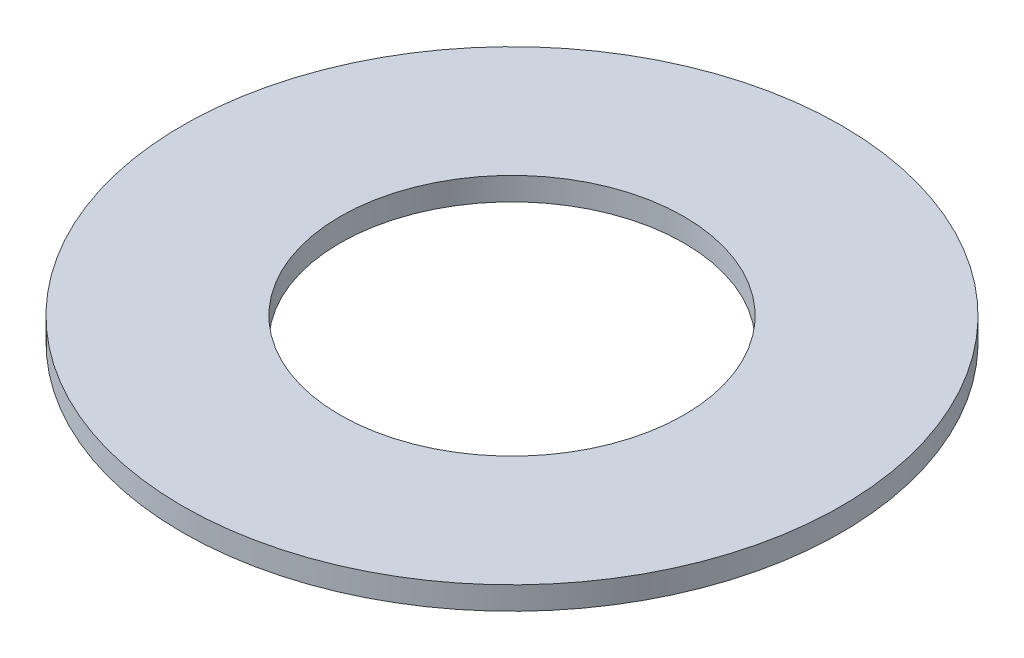
ISO-10303-21;
HEADER;
FILE_DESCRIPTION(('STEP AP214'),'2;1');
FILE_NAME('part.step','',(''),(''),'','','');
FILE_SCHEMA(('AUTOMOTIVE_DESIGN { 1 0 10303 214 1 1 1 1 }'));
ENDSEC;
DATA;
#1=APPLICATION_CONTEXT('core data for automotive mechanical design processes');
#2=APPLICATION_PROTOCOL_DEFINITION('international standard','automotive_design',2000,#1);
#3=PRODUCT_CONTEXT('',#1,'mechanical');
#4=PRODUCT('Part','Part','',(#3));
#5=PRODUCT_RELATED_PRODUCT_CATEGORY('part','',(#4));
#6=PRODUCT_DEFINITION_FORMATION('','',#4);
#7=PRODUCT_DEFINITION_CONTEXT('part definition',#1,'design');
#8=PRODUCT_DEFINITION('design','',#6,#7);
#9=PRODUCT_DEFINITION_SHAPE('','',#8);
#10=(LENGTH_UNIT() NAMED_UNIT(*) SI_UNIT(.MILLI.,.METRE.));
#11=(NAMED_UNIT(*) PLANE_ANGLE_UNIT() SI_UNIT($,.RADIAN.));
#12=(NAMED_UNIT(*) SI_UNIT($,.STERADIAN.) SOLID_ANGLE_UNIT());
#13=UNCERTAINTY_MEASURE_WITH_UNIT(LENGTH_MEASURE(1.E-05),#10,'distance_accuracy_value','');
#14=(GEOMETRIC_REPRESENTATION_CONTEXT(3) GLOBAL_UNCERTAINTY_ASSIGNED_CONTEXT((#13)) GLOBAL_UNIT_ASSIGNED_CONTEXT((#10,
#11,#12)) REPRESENTATION_CONTEXT('',''));
#15=CARTESIAN_POINT('',(0.,0.,0.));
#16=DIRECTION('',(0.,0.,1.));
#17=DIRECTION('',(1.,0.,0.));
#18=AXIS2_PLACEMENT_3D('',#15,#16,#17);
#19=CARTESIAN_POINT('',(0.,4.,0.));
#20=DIRECTION('',(0.,-1.,0.));
#21=DIRECTION('',(0.,0.,-1.));
#22=AXIS2_PLACEMENT_3D('',#19,#20,#21);
#23=CYLINDRICAL_SURFACE('',#22,57.5);
#24=CARTESIAN_POINT('',(0.,4.,0.));
#25=DIRECTION('',(0.,1.,0.));
#26=DIRECTION('',(0.,0.,1.));
#27=AXIS2_PLACEMENT_3D('',#24,#25,#26);
#28=CIRCLE('',#27,57.5);
#29=CARTESIAN_POINT('',(0.,4.,57.5));
#30=VERTEX_POINT('',#29);
#31=EDGE_CURVE('E10',#30,#30,#28,.T.);
#32=ORIENTED_EDGE('',*,*,#31,.F.);
#33=EDGE_LOOP('',(#32));
#34=FACE_BOUND('',#33,.T.);
#35=CARTESIAN_POINT('',(0.,0.,0.));
#36=DIRECTION('',(0.,1.,0.));
#37=DIRECTION('',(0.,0.,1.));
#38=AXIS2_PLACEMENT_3D('',#35,#36,#37);
#39=CIRCLE('',#38,57.5);
#40=CARTESIAN_POINT('',(0.,0.,57.5));
#41=VERTEX_POINT('',#40);
#42=EDGE_CURVE('E37',#41,#41,#39,.T.);
#43=ORIENTED_EDGE('',*,*,#42,.T.);
#44=EDGE_LOOP('',(#43));
#45=FACE_BOUND('',#44,.T.);
#46=ADVANCED_FACE('F40',(#34,#45),#23,.T.);
#47=CARTESIAN_POINT('',(0.,4.,0.));
#48=DIRECTION('',(0.,1.,0.));
#49=DIRECTION('',(0.,0.,1.));
#50=AXIS2_PLACEMENT_3D('',#47,#48,#49);
#51=PLANE('',#50);
#52=CARTESIAN_POINT('',(0.,4.,0.));
#53=DIRECTION('',(0.,1.,0.));
#54=DIRECTION('',(0.,0.,1.));
#55=AXIS2_PLACEMENT_3D('',#52,#53,#54);
#56=CIRCLE('',#55,30.);
#57=CARTESIAN_POINT('',(0.,4.,30.));
#58=VERTEX_POINT('',#57);
#59=EDGE_CURVE('E50',#58,#58,#56,.T.);
#60=ORIENTED_EDGE('',*,*,#59,.F.);
#61=EDGE_LOOP('',(#60));
#62=FACE_BOUND('',#61,.T.);
#63=ORIENTED_EDGE('',*,*,#31,.T.);
#64=EDGE_LOOP('',(#63));
#65=FACE_BOUND('',#64,.T.);
#66=ADVANCED_FACE('F59',(#62,#65),#51,.T.);
#67=CARTESIAN_POINT('',(0.,0.,0.));
#68=DIRECTION('',(0.,1.,0.));
#69=DIRECTION('',(0.,0.,1.));
#70=AXIS2_PLACEMENT_3D('',#67,#68,#69);
#71=PLANE('',#70);
#72=CARTESIAN_POINT('',(0.,0.,0.));
#73=DIRECTION('',(0.,1.,0.));
#74=DIRECTION('',(0.,0.,1.));
#75=AXIS2_PLACEMENT_3D('',#72,#73,#74);
#76=CIRCLE('',#75,30.);
#77=CARTESIAN_POINT('',(0.,0.,30.));
#78=VERTEX_POINT('',#77);
#79=EDGE_CURVE('E47',#78,#78,#76,.T.);
#80=ORIENTED_EDGE('',*,*,#79,.T.);
#81=EDGE_LOOP('',(#80));
#82=FACE_BOUND('',#81,.T.);
#83=ORIENTED_EDGE('',*,*,#42,.F.);
#84=EDGE_LOOP('',(#83));
#85=FACE_BOUND('',#84,.T.);
#86=ADVANCED_FACE('F58',(#82,#85),#71,.F.);
#87=CARTESIAN_POINT('',(0.,4.,0.));
#88=DIRECTION('',(0.,-1.,0.));
#89=DIRECTION('',(0.,0.,-1.));
#90=AXIS2_PLACEMENT_3D('',#87,#88,#89);
#91=CYLINDRICAL_SURFACE('',#90,30.);
#92=ORIENTED_EDGE('',*,*,#59,.T.);
#93=EDGE_LOOP('',(#92));
#94=FACE_BOUND('',#93,.T.);
#95=ORIENTED_EDGE('',*,*,#79,.F.);
#96=EDGE_LOOP('',(#95));
#97=FACE_BOUND('',#96,.T.);
#98=ADVANCED_FACE('F54',(#94,#97),#91,.F.);
#99=CLOSED_SHELL('',(#46,#66,#86,#98));
#100=MANIFOLD_SOLID_BREP('B2',#99);
#101=ADVANCED_BREP_SHAPE_REPRESENTATION('',(#18,#100),#14);
#102=SHAPE_DEFINITION_REPRESENTATION(#9,#101);
ENDSEC;
END-ISO-10303-21;
